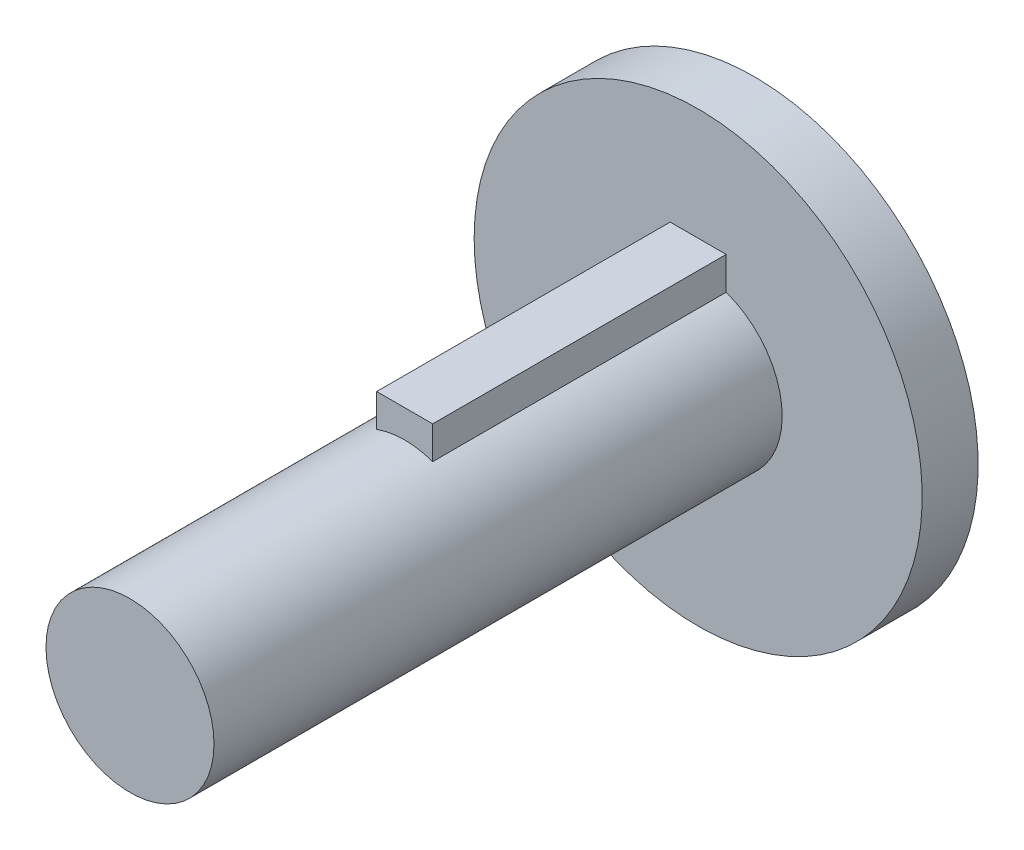
ISO-10303-21;
HEADER;
FILE_DESCRIPTION(('STEP AP214'),'2;1');
FILE_NAME('part.step','',(''),(''),'','','');
FILE_SCHEMA(('AUTOMOTIVE_DESIGN { 1 0 10303 214 1 1 1 1 }'));
ENDSEC;
DATA;
#1=APPLICATION_CONTEXT('core data for automotive mechanical design processes');
#2=APPLICATION_PROTOCOL_DEFINITION('international standard','automotive_design',2000,#1);
#3=PRODUCT_CONTEXT('',#1,'mechanical');
#4=PRODUCT('Part','Part','',(#3));
#5=PRODUCT_RELATED_PRODUCT_CATEGORY('part','',(#4));
#6=PRODUCT_DEFINITION_FORMATION('','',#4);
#7=PRODUCT_DEFINITION_CONTEXT('part definition',#1,'design');
#8=PRODUCT_DEFINITION('design','',#6,#7);
#9=PRODUCT_DEFINITION_SHAPE('','',#8);
#10=(LENGTH_UNIT() NAMED_UNIT(*) SI_UNIT(.MILLI.,.METRE.));
#11=(NAMED_UNIT(*) PLANE_ANGLE_UNIT() SI_UNIT($,.RADIAN.));
#12=(NAMED_UNIT(*) SI_UNIT($,.STERADIAN.) SOLID_ANGLE_UNIT());
#13=UNCERTAINTY_MEASURE_WITH_UNIT(LENGTH_MEASURE(1.E-05),#10,'distance_accuracy_value','');
#14=(GEOMETRIC_REPRESENTATION_CONTEXT(3) GLOBAL_UNCERTAINTY_ASSIGNED_CONTEXT((#13)) GLOBAL_UNIT_ASSIGNED_CONTEXT((#10,
#11,#12)) REPRESENTATION_CONTEXT('',''));
#15=CARTESIAN_POINT('',(0.,0.,0.));
#16=DIRECTION('',(0.,0.,1.));
#17=DIRECTION('',(1.,0.,0.));
#18=AXIS2_PLACEMENT_3D('',#15,#16,#17);
#19=CARTESIAN_POINT('',(0.,0.,20.29));
#20=DIRECTION('',(0.,0.,-1.));
#21=DIRECTION('',(-1.,0.,0.));
#22=AXIS2_PLACEMENT_3D('',#19,#20,#21);
#23=CYLINDRICAL_SURFACE('',#22,3.);
#24=CARTESIAN_POINT('',(0.,0.,0.));
#25=DIRECTION('',(0.,0.,1.));
#26=DIRECTION('',(1.,0.,0.));
#27=AXIS2_PLACEMENT_3D('',#24,#25,#26);
#28=CIRCLE('',#27,3.);
#29=CARTESIAN_POINT('',(-1.,2.82842712474619,0.));
#30=VERTEX_POINT('',#29);
#31=CARTESIAN_POINT('',(1.,2.82842712474619,0.));
#32=VERTEX_POINT('',#31);
#33=EDGE_CURVE('E77',#30,#32,#28,.T.);
#34=ORIENTED_EDGE('',*,*,#33,.T.);
#35=DIRECTION('',(0.,0.,-1.));
#36=VECTOR('',#35,1.);
#37=CARTESIAN_POINT('',(1.,2.82842712474619,10.48));
#38=LINE('',#37,#36);
#39=CARTESIAN_POINT('',(1.,2.82842712474619,10.48));
#40=VERTEX_POINT('',#39);
#41=EDGE_CURVE('E52',#40,#32,#38,.T.);
#42=ORIENTED_EDGE('',*,*,#41,.F.);
#43=CARTESIAN_POINT('',(0.,0.,10.48));
#44=DIRECTION('',(0.,0.,1.));
#45=DIRECTION('',(1.,0.,0.));
#46=AXIS2_PLACEMENT_3D('',#43,#44,#45);
#47=CIRCLE('',#46,3.);
#48=CARTESIAN_POINT('',(-1.,2.82842712474619,10.48));
#49=VERTEX_POINT('',#48);
#50=EDGE_CURVE('E11',#40,#49,#47,.T.);
#51=ORIENTED_EDGE('',*,*,#50,.T.);
#52=DIRECTION('',(0.,0.,-1.));
#53=VECTOR('',#52,1.);
#54=CARTESIAN_POINT('',(-1.,2.82842712474619,10.48));
#55=LINE('',#54,#53);
#56=EDGE_CURVE('E82',#49,#30,#55,.T.);
#57=ORIENTED_EDGE('',*,*,#56,.T.);
#58=EDGE_LOOP('',(#34,#42,#51,#57));
#59=FACE_BOUND('',#58,.T.);
#60=CARTESIAN_POINT('',(0.,0.,20.29));
#61=DIRECTION('',(0.,0.,1.));
#62=DIRECTION('',(1.,0.,0.));
#63=AXIS2_PLACEMENT_3D('',#60,#61,#62);
#64=CIRCLE('',#63,3.);
#65=CARTESIAN_POINT('',(3.,0.,20.29));
#66=VERTEX_POINT('',#65);
#67=EDGE_CURVE('E42',#66,#66,#64,.T.);
#68=ORIENTED_EDGE('',*,*,#67,.F.);
#69=EDGE_LOOP('',(#68));
#70=FACE_BOUND('',#69,.T.);
#71=ADVANCED_FACE('F35',(#59,#70),#23,.T.);
#72=CARTESIAN_POINT('',(0.,0.,20.29));
#73=DIRECTION('',(0.,0.,1.));
#74=DIRECTION('',(1.,0.,0.));
#75=AXIS2_PLACEMENT_3D('',#72,#73,#74);
#76=PLANE('',#75);
#77=ORIENTED_EDGE('',*,*,#67,.T.);
#78=EDGE_LOOP('',(#77));
#79=FACE_BOUND('',#78,.T.);
#80=ADVANCED_FACE('F106',(#79),#76,.T.);
#81=CARTESIAN_POINT('',(1.,2.82842712474619,10.48));
#82=DIRECTION('',(1.,0.,0.));
#83=DIRECTION('',(0.,0.,-1.));
#84=AXIS2_PLACEMENT_3D('',#81,#82,#83);
#85=PLANE('',#84);
#86=DIRECTION('',(0.,-1.,0.));
#87=VECTOR('',#86,1.);
#88=CARTESIAN_POINT('',(1.,2.82842712474619,0.));
#89=LINE('',#88,#87);
#90=CARTESIAN_POINT('',(1.,3.99842712474619,0.));
#91=VERTEX_POINT('',#90);
#92=EDGE_CURVE('E73',#91,#32,#89,.T.);
#93=ORIENTED_EDGE('',*,*,#92,.F.);
#94=DIRECTION('',(0.,0.,-1.));
#95=VECTOR('',#94,1.);
#96=CARTESIAN_POINT('',(1.,3.99842712474619,10.48));
#97=LINE('',#96,#95);
#98=CARTESIAN_POINT('',(1.,3.99842712474619,10.48));
#99=VERTEX_POINT('',#98);
#100=EDGE_CURVE('E78',#99,#91,#97,.T.);
#101=ORIENTED_EDGE('',*,*,#100,.F.);
#102=DIRECTION('',(0.,-1.,0.));
#103=VECTOR('',#102,1.);
#104=CARTESIAN_POINT('',(1.,2.82842712474619,10.48));
#105=LINE('',#104,#103);
#106=EDGE_CURVE('E76',#99,#40,#105,.T.);
#107=ORIENTED_EDGE('',*,*,#106,.T.);
#108=ORIENTED_EDGE('',*,*,#41,.T.);
#109=EDGE_LOOP('',(#93,#101,#107,#108));
#110=FACE_BOUND('',#109,.T.);
#111=ADVANCED_FACE('F71',(#110),#85,.T.);
#112=CARTESIAN_POINT('',(1.,3.99842712474619,10.48));
#113=DIRECTION('',(0.,1.,0.));
#114=DIRECTION('',(0.,0.,1.));
#115=AXIS2_PLACEMENT_3D('',#112,#113,#114);
#116=PLANE('',#115);
#117=DIRECTION('',(1.,0.,0.));
#118=VECTOR('',#117,1.);
#119=CARTESIAN_POINT('',(1.,3.99842712474619,0.));
#120=LINE('',#119,#118);
#121=CARTESIAN_POINT('',(-1.,3.99842712474619,0.));
#122=VERTEX_POINT('',#121);
#123=EDGE_CURVE('E89',#122,#91,#120,.T.);
#124=ORIENTED_EDGE('',*,*,#123,.F.);
#125=DIRECTION('',(0.,0.,-1.));
#126=VECTOR('',#125,1.);
#127=CARTESIAN_POINT('',(-1.,3.99842712474619,10.48));
#128=LINE('',#127,#126);
#129=CARTESIAN_POINT('',(-1.,3.99842712474619,10.48));
#130=VERTEX_POINT('',#129);
#131=EDGE_CURVE('E100',#130,#122,#128,.T.);
#132=ORIENTED_EDGE('',*,*,#131,.F.);
#133=DIRECTION('',(1.,0.,0.));
#134=VECTOR('',#133,1.);
#135=CARTESIAN_POINT('',(1.,3.99842712474619,10.48));
#136=LINE('',#135,#134);
#137=EDGE_CURVE('E93',#130,#99,#136,.T.);
#138=ORIENTED_EDGE('',*,*,#137,.T.);
#139=ORIENTED_EDGE('',*,*,#100,.T.);
#140=EDGE_LOOP('',(#124,#132,#138,#139));
#141=FACE_BOUND('',#140,.T.);
#142=ADVANCED_FACE('F114',(#141),#116,.T.);
#143=CARTESIAN_POINT('',(-1.,3.99842712474619,10.48));
#144=DIRECTION('',(-1.,0.,0.));
#145=DIRECTION('',(0.,0.,1.));
#146=AXIS2_PLACEMENT_3D('',#143,#144,#145);
#147=PLANE('',#146);
#148=DIRECTION('',(0.,1.,0.));
#149=VECTOR('',#148,1.);
#150=CARTESIAN_POINT('',(-1.,3.99842712474619,0.));
#151=LINE('',#150,#149);
#152=EDGE_CURVE('E95',#30,#122,#151,.T.);
#153=ORIENTED_EDGE('',*,*,#152,.F.);
#154=ORIENTED_EDGE('',*,*,#56,.F.);
#155=DIRECTION('',(0.,1.,0.));
#156=VECTOR('',#155,1.);
#157=CARTESIAN_POINT('',(-1.,3.99842712474619,10.48));
#158=LINE('',#157,#156);
#159=EDGE_CURVE('E90',#49,#130,#158,.T.);
#160=ORIENTED_EDGE('',*,*,#159,.T.);
#161=ORIENTED_EDGE('',*,*,#131,.T.);
#162=EDGE_LOOP('',(#153,#154,#160,#161));
#163=FACE_BOUND('',#162,.T.);
#164=ADVANCED_FACE('F117',(#163),#147,.T.);
#165=CARTESIAN_POINT('',(0.,0.,10.48));
#166=DIRECTION('',(0.,0.,1.));
#167=DIRECTION('',(1.,0.,0.));
#168=AXIS2_PLACEMENT_3D('',#165,#166,#167);
#169=PLANE('',#168);
#170=ORIENTED_EDGE('',*,*,#50,.F.);
#171=ORIENTED_EDGE('',*,*,#106,.F.);
#172=ORIENTED_EDGE('',*,*,#137,.F.);
#173=ORIENTED_EDGE('',*,*,#159,.F.);
#174=EDGE_LOOP('',(#170,#171,#172,#173));
#175=FACE_BOUND('',#174,.T.);
#176=ADVANCED_FACE('F120',(#175),#169,.T.);
#177=CARTESIAN_POINT('',(0.,0.,-2.));
#178=DIRECTION('',(0.,0.,1.));
#179=DIRECTION('',(1.,0.,0.));
#180=AXIS2_PLACEMENT_3D('',#177,#178,#179);
#181=CYLINDRICAL_SURFACE('',#180,8.);
#182=CARTESIAN_POINT('',(0.,0.,-2.));
#183=DIRECTION('',(0.,0.,-1.));
#184=DIRECTION('',(-1.,0.,0.));
#185=AXIS2_PLACEMENT_3D('',#182,#183,#184);
#186=CIRCLE('',#185,8.);
#187=CARTESIAN_POINT('',(-8.,0.,-2.));
#188=VERTEX_POINT('',#187);
#189=EDGE_CURVE('E141',#188,#188,#186,.T.);
#190=ORIENTED_EDGE('',*,*,#189,.F.);
#191=EDGE_LOOP('',(#190));
#192=FACE_BOUND('',#191,.T.);
#193=CARTESIAN_POINT('',(0.,0.,0.));
#194=DIRECTION('',(0.,0.,-1.));
#195=DIRECTION('',(-1.,0.,0.));
#196=AXIS2_PLACEMENT_3D('',#193,#194,#195);
#197=CIRCLE('',#196,8.);
#198=CARTESIAN_POINT('',(-8.,0.,0.));
#199=VERTEX_POINT('',#198);
#200=EDGE_CURVE('E142',#199,#199,#197,.T.);
#201=ORIENTED_EDGE('',*,*,#200,.T.);
#202=EDGE_LOOP('',(#201));
#203=FACE_BOUND('',#202,.T.);
#204=ADVANCED_FACE('F127',(#192,#203),#181,.T.);
#205=CARTESIAN_POINT('',(0.,0.,-2.));
#206=DIRECTION('',(0.,0.,-1.));
#207=DIRECTION('',(-1.,0.,0.));
#208=AXIS2_PLACEMENT_3D('',#205,#206,#207);
#209=PLANE('',#208);
#210=ORIENTED_EDGE('',*,*,#189,.T.);
#211=EDGE_LOOP('',(#210));
#212=FACE_BOUND('',#211,.T.);
#213=ADVANCED_FACE('F131',(#212),#209,.T.);
#214=CARTESIAN_POINT('',(0.,0.,0.));
#215=DIRECTION('',(0.,0.,-1.));
#216=DIRECTION('',(-1.,0.,0.));
#217=AXIS2_PLACEMENT_3D('',#214,#215,#216);
#218=PLANE('',#217);
#219=ORIENTED_EDGE('',*,*,#33,.F.);
#220=ORIENTED_EDGE('',*,*,#152,.T.);
#221=ORIENTED_EDGE('',*,*,#123,.T.);
#222=ORIENTED_EDGE('',*,*,#92,.T.);
#223=EDGE_LOOP('',(#219,#220,#221,#222));
#224=FACE_BOUND('',#223,.T.);
#225=ORIENTED_EDGE('',*,*,#200,.F.);
#226=EDGE_LOOP('',(#225));
#227=FACE_BOUND('',#226,.T.);
#228=ADVANCED_FACE('F86',(#224,#227),#218,.F.);
#229=CLOSED_SHELL('',(#71,#80,#111,#142,#164,#176,#204,#213,#228));
#230=MANIFOLD_SOLID_BREP('B2',#229);
#231=ADVANCED_BREP_SHAPE_REPRESENTATION('',(#18,#230),#14);
#232=SHAPE_DEFINITION_REPRESENTATION(#9,#231);
ENDSEC;
END-ISO-10303-21;
